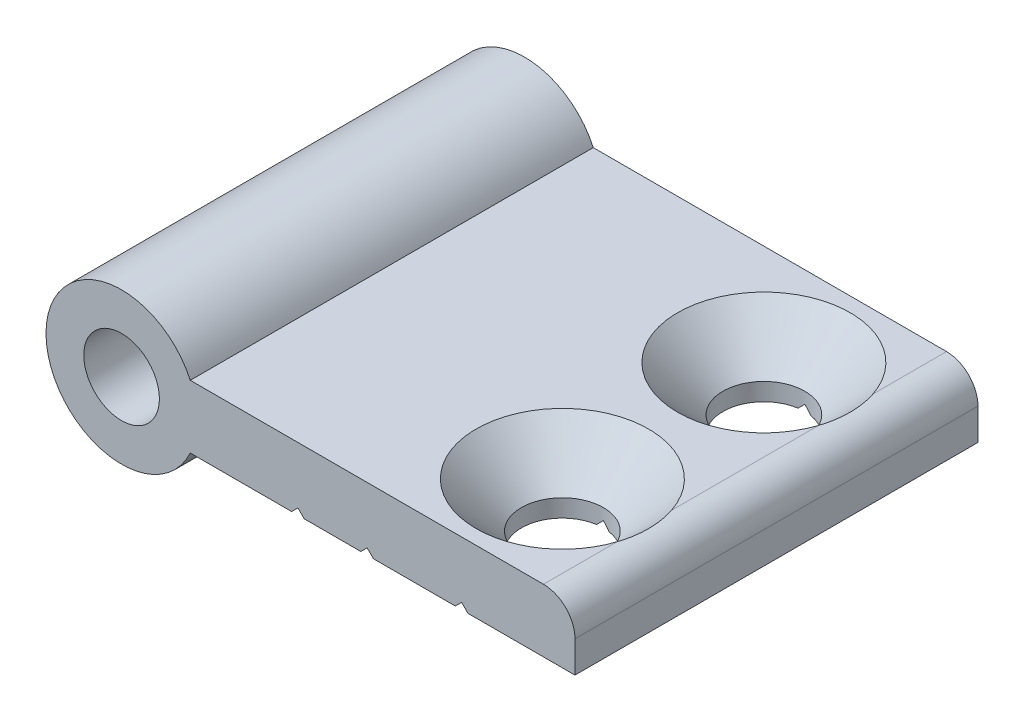
ISO-10303-21;
HEADER;
FILE_DESCRIPTION(('STEP AP214'),'2;1');
FILE_NAME('part.step','',(''),(''),'','','');
FILE_SCHEMA(('AUTOMOTIVE_DESIGN { 1 0 10303 214 1 1 1 1 }'));
ENDSEC;
DATA;
#1=APPLICATION_CONTEXT('core data for automotive mechanical design processes');
#2=APPLICATION_PROTOCOL_DEFINITION('international standard','automotive_design',2000,#1);
#3=PRODUCT_CONTEXT('',#1,'mechanical');
#4=PRODUCT('Part','Part','',(#3));
#5=PRODUCT_RELATED_PRODUCT_CATEGORY('part','',(#4));
#6=PRODUCT_DEFINITION_FORMATION('','',#4);
#7=PRODUCT_DEFINITION_CONTEXT('part definition',#1,'design');
#8=PRODUCT_DEFINITION('design','',#6,#7);
#9=PRODUCT_DEFINITION_SHAPE('','',#8);
#10=(LENGTH_UNIT() NAMED_UNIT(*) SI_UNIT(.MILLI.,.METRE.));
#11=(NAMED_UNIT(*) PLANE_ANGLE_UNIT() SI_UNIT($,.RADIAN.));
#12=(NAMED_UNIT(*) SI_UNIT($,.STERADIAN.) SOLID_ANGLE_UNIT());
#13=UNCERTAINTY_MEASURE_WITH_UNIT(LENGTH_MEASURE(1.E-05),#10,'distance_accuracy_value','');
#14=(GEOMETRIC_REPRESENTATION_CONTEXT(3) GLOBAL_UNCERTAINTY_ASSIGNED_CONTEXT((#13)) GLOBAL_UNIT_ASSIGNED_CONTEXT((#10,
#11,#12)) REPRESENTATION_CONTEXT('',''));
#15=CARTESIAN_POINT('',(0.,0.,0.));
#16=DIRECTION('',(0.,0.,1.));
#17=DIRECTION('',(1.,0.,0.));
#18=AXIS2_PLACEMENT_3D('',#15,#16,#17);
#19=CARTESIAN_POINT('',(19.,-2.5,0.));
#20=DIRECTION('',(0.707106781186547,-0.707106781186548,0.));
#21=DIRECTION('',(0.707106781186548,0.707106781186547,0.));
#22=AXIS2_PLACEMENT_3D('',#19,#20,#21);
#23=PLANE('',#22);
#24=DIRECTION('',(0.707106781186548,0.707106781186547,0.));
#25=VECTOR('',#24,1.);
#26=CARTESIAN_POINT('',(19.,-2.5,16.));
#27=LINE('',#26,#25);
#28=CARTESIAN_POINT('',(19.5,-2.,16.));
#29=VERTEX_POINT('',#28);
#30=CARTESIAN_POINT('',(19.,-2.5,16.));
#31=VERTEX_POINT('',#30);
#32=EDGE_CURVE('E248',#29,#31,#27,.F.);
#33=ORIENTED_EDGE('',*,*,#32,.T.);
#34=DIRECTION('',(0.,0.,-1.));
#35=VECTOR('',#34,1.);
#36=CARTESIAN_POINT('',(19.,-2.5,0.));
#37=LINE('',#36,#35);
#38=CARTESIAN_POINT('',(19.,-2.5,-16.));
#39=VERTEX_POINT('',#38);
#40=EDGE_CURVE('E139',#39,#31,#37,.F.);
#41=ORIENTED_EDGE('',*,*,#40,.F.);
#42=DIRECTION('',(0.707106781186548,0.707106781186547,0.));
#43=VECTOR('',#42,1.);
#44=CARTESIAN_POINT('',(19.,-2.5,-16.));
#45=LINE('',#44,#43);
#46=CARTESIAN_POINT('',(19.5,-2.,-16.));
#47=VERTEX_POINT('',#46);
#48=EDGE_CURVE('E252',#39,#47,#45,.T.);
#49=ORIENTED_EDGE('',*,*,#48,.T.);
#50=DIRECTION('',(0.,0.,1.));
#51=VECTOR('',#50,1.);
#52=CARTESIAN_POINT('',(19.5,-2.,0.));
#53=LINE('',#52,#51);
#54=EDGE_CURVE('E230',#29,#47,#53,.F.);
#55=ORIENTED_EDGE('',*,*,#54,.F.);
#56=EDGE_LOOP('',(#33,#41,#49,#55));
#57=FACE_BOUND('',#56,.T.);
#58=ADVANCED_FACE('F16',(#57),#23,.T.);
#59=CARTESIAN_POINT('',(14.,-2.,0.));
#60=DIRECTION('',(-0.707106781186547,-0.707106781186548,0.));
#61=DIRECTION('',(0.707106781186548,-0.707106781186547,0.));
#62=AXIS2_PLACEMENT_3D('',#59,#60,#61);
#63=PLANE('',#62);
#64=DIRECTION('',(0.707106781186548,-0.707106781186547,0.));
#65=VECTOR('',#64,1.);
#66=CARTESIAN_POINT('',(14.,-2.,16.));
#67=LINE('',#66,#65);
#68=CARTESIAN_POINT('',(14.5,-2.5,16.));
#69=VERTEX_POINT('',#68);
#70=CARTESIAN_POINT('',(14.,-2.,16.));
#71=VERTEX_POINT('',#70);
#72=EDGE_CURVE('E243',#69,#71,#67,.F.);
#73=ORIENTED_EDGE('',*,*,#72,.T.);
#74=DIRECTION('',(0.,0.,1.));
#75=VECTOR('',#74,1.);
#76=CARTESIAN_POINT('',(14.,-2.,0.));
#77=LINE('',#76,#75);
#78=CARTESIAN_POINT('',(14.,-2.,-16.));
#79=VERTEX_POINT('',#78);
#80=EDGE_CURVE('E145',#79,#71,#77,.T.);
#81=ORIENTED_EDGE('',*,*,#80,.F.);
#82=DIRECTION('',(0.707106781186548,-0.707106781186547,0.));
#83=VECTOR('',#82,1.);
#84=CARTESIAN_POINT('',(14.,-2.,-16.));
#85=LINE('',#84,#83);
#86=CARTESIAN_POINT('',(14.5,-2.5,-16.));
#87=VERTEX_POINT('',#86);
#88=EDGE_CURVE('E251',#79,#87,#85,.T.);
#89=ORIENTED_EDGE('',*,*,#88,.T.);
#90=DIRECTION('',(0.,0.,-1.));
#91=VECTOR('',#90,1.);
#92=CARTESIAN_POINT('',(14.5,-2.5,0.));
#93=LINE('',#92,#91);
#94=EDGE_CURVE('E136',#69,#87,#93,.T.);
#95=ORIENTED_EDGE('',*,*,#94,.F.);
#96=EDGE_LOOP('',(#73,#81,#89,#95));
#97=FACE_BOUND('',#96,.T.);
#98=ADVANCED_FACE('F354',(#97),#63,.T.);
#99=CARTESIAN_POINT('',(26.5,-2.5,0.));
#100=DIRECTION('',(0.707106781186549,-0.707106781186546,0.));
#101=DIRECTION('',(0.707106781186546,0.707106781186549,0.));
#102=AXIS2_PLACEMENT_3D('',#99,#100,#101);
#103=PLANE('',#102);
#104=CARTESIAN_POINT('',(27.,-2.,8.));
#105=DIRECTION('',(0.707106781186549,-0.707106781186546,0.));
#106=DIRECTION('',(-0.707106781186546,-0.707106781186549,0.));
#107=AXIS2_PLACEMENT_3D('',#104,#105,#106);
#108=ELLIPSE('',#107,4.59619407771257,3.25);
#109=CARTESIAN_POINT('',(27.,-2.,4.75));
#110=VERTEX_POINT('',#109);
#111=CARTESIAN_POINT('',(26.5,-2.5,4.78869185533372));
#112=VERTEX_POINT('',#111);
#113=EDGE_CURVE('E126',#110,#112,#108,.F.);
#114=ORIENTED_EDGE('',*,*,#113,.T.);
#115=DIRECTION('',(0.,0.,-1.));
#116=VECTOR('',#115,1.);
#117=CARTESIAN_POINT('',(26.5,-2.5,0.));
#118=LINE('',#117,#116);
#119=CARTESIAN_POINT('',(26.5,-2.5,-4.78869185533371));
#120=VERTEX_POINT('',#119);
#121=EDGE_CURVE('E123',#120,#112,#118,.F.);
#122=ORIENTED_EDGE('',*,*,#121,.F.);
#123=CARTESIAN_POINT('',(27.,-2.,-8.));
#124=DIRECTION('',(0.707106781186549,-0.707106781186546,0.));
#125=DIRECTION('',(-0.707106781186546,-0.707106781186549,0.));
#126=AXIS2_PLACEMENT_3D('',#123,#124,#125);
#127=ELLIPSE('',#126,4.59619407771257,3.25);
#128=CARTESIAN_POINT('',(27.,-2.,-4.75));
#129=VERTEX_POINT('',#128);
#130=EDGE_CURVE('E21',#120,#129,#127,.F.);
#131=ORIENTED_EDGE('',*,*,#130,.T.);
#132=DIRECTION('',(0.,0.,1.));
#133=VECTOR('',#132,1.);
#134=CARTESIAN_POINT('',(27.,-2.,0.));
#135=LINE('',#134,#133);
#136=EDGE_CURVE('E121',#110,#129,#135,.F.);
#137=ORIENTED_EDGE('',*,*,#136,.F.);
#138=EDGE_LOOP('',(#114,#122,#131,#137));
#139=FACE_BOUND('',#138,.T.);
#140=ADVANCED_FACE('F124',(#139),#103,.T.);
#141=CARTESIAN_POINT('',(26.5,-2.5,0.));
#142=DIRECTION('',(0.707106781186549,-0.707106781186546,0.));
#143=DIRECTION('',(0.707106781186546,0.707106781186549,0.));
#144=AXIS2_PLACEMENT_3D('',#141,#142,#143);
#145=PLANE('',#144);
#146=DIRECTION('',(0.707106781186546,0.707106781186549,0.));
#147=VECTOR('',#146,1.);
#148=CARTESIAN_POINT('',(26.5,-2.5,16.));
#149=LINE('',#148,#147);
#150=CARTESIAN_POINT('',(27.,-2.,16.));
#151=VERTEX_POINT('',#150);
#152=CARTESIAN_POINT('',(26.5,-2.5,16.));
#153=VERTEX_POINT('',#152);
#154=EDGE_CURVE('E240',#151,#153,#149,.F.);
#155=ORIENTED_EDGE('',*,*,#154,.T.);
#156=DIRECTION('',(0.,0.,-1.));
#157=VECTOR('',#156,1.);
#158=CARTESIAN_POINT('',(26.5,-2.5,0.));
#159=LINE('',#158,#157);
#160=CARTESIAN_POINT('',(26.5,-2.5,11.2113081446663));
#161=VERTEX_POINT('',#160);
#162=EDGE_CURVE('E189',#161,#153,#159,.F.);
#163=ORIENTED_EDGE('',*,*,#162,.F.);
#164=CARTESIAN_POINT('',(27.,-2.,8.));
#165=DIRECTION('',(0.707106781186549,-0.707106781186546,0.));
#166=DIRECTION('',(-0.707106781186546,-0.707106781186549,0.));
#167=AXIS2_PLACEMENT_3D('',#164,#165,#166);
#168=ELLIPSE('',#167,4.59619407771257,3.25);
#169=CARTESIAN_POINT('',(27.,-2.,11.25));
#170=VERTEX_POINT('',#169);
#171=EDGE_CURVE('E151',#161,#170,#168,.F.);
#172=ORIENTED_EDGE('',*,*,#171,.T.);
#173=DIRECTION('',(0.,0.,1.));
#174=VECTOR('',#173,1.);
#175=CARTESIAN_POINT('',(27.,-2.,0.));
#176=LINE('',#175,#174);
#177=EDGE_CURVE('E215',#151,#170,#176,.F.);
#178=ORIENTED_EDGE('',*,*,#177,.F.);
#179=EDGE_LOOP('',(#155,#163,#172,#178));
#180=FACE_BOUND('',#179,.T.);
#181=ADVANCED_FACE('F347',(#180),#145,.T.);
#182=CARTESIAN_POINT('',(19.5,-2.,0.));
#183=DIRECTION('',(-0.707106781186546,-0.707106781186549,0.));
#184=DIRECTION('',(0.707106781186549,-0.707106781186546,0.));
#185=AXIS2_PLACEMENT_3D('',#182,#183,#184);
#186=PLANE('',#185);
#187=DIRECTION('',(0.707106781186549,-0.707106781186546,0.));
#188=VECTOR('',#187,1.);
#189=CARTESIAN_POINT('',(19.5,-2.,16.));
#190=LINE('',#189,#188);
#191=CARTESIAN_POINT('',(20.,-2.5,16.));
#192=VERTEX_POINT('',#191);
#193=EDGE_CURVE('E234',#192,#29,#190,.F.);
#194=ORIENTED_EDGE('',*,*,#193,.T.);
#195=ORIENTED_EDGE('',*,*,#54,.T.);
#196=DIRECTION('',(0.707106781186549,-0.707106781186546,0.));
#197=VECTOR('',#196,1.);
#198=CARTESIAN_POINT('',(19.5,-2.,-16.));
#199=LINE('',#198,#197);
#200=CARTESIAN_POINT('',(20.,-2.5,-16.));
#201=VERTEX_POINT('',#200);
#202=EDGE_CURVE('E237',#47,#201,#199,.T.);
#203=ORIENTED_EDGE('',*,*,#202,.T.);
#204=DIRECTION('',(0.,0.,-1.));
#205=VECTOR('',#204,1.);
#206=CARTESIAN_POINT('',(20.,-2.5,0.));
#207=LINE('',#206,#205);
#208=EDGE_CURVE('E186',#192,#201,#207,.T.);
#209=ORIENTED_EDGE('',*,*,#208,.F.);
#210=EDGE_LOOP('',(#194,#195,#203,#209));
#211=FACE_BOUND('',#210,.T.);
#212=ADVANCED_FACE('F343',(#211),#186,.T.);
#213=CARTESIAN_POINT('',(26.5,-2.5,0.));
#214=DIRECTION('',(0.707106781186549,-0.707106781186546,0.));
#215=DIRECTION('',(0.707106781186546,0.707106781186549,0.));
#216=AXIS2_PLACEMENT_3D('',#213,#214,#215);
#217=PLANE('',#216);
#218=DIRECTION('',(0.707106781186546,0.707106781186549,0.));
#219=VECTOR('',#218,1.);
#220=CARTESIAN_POINT('',(26.5,-2.5,-16.));
#221=LINE('',#220,#219);
#222=CARTESIAN_POINT('',(26.5,-2.5,-16.));
#223=VERTEX_POINT('',#222);
#224=CARTESIAN_POINT('',(27.,-2.,-16.));
#225=VERTEX_POINT('',#224);
#226=EDGE_CURVE('E225',#223,#225,#221,.T.);
#227=ORIENTED_EDGE('',*,*,#226,.T.);
#228=DIRECTION('',(0.,0.,1.));
#229=VECTOR('',#228,1.);
#230=CARTESIAN_POINT('',(27.,-2.,0.));
#231=LINE('',#230,#229);
#232=CARTESIAN_POINT('',(27.,-2.,-11.25));
#233=VERTEX_POINT('',#232);
#234=EDGE_CURVE('E222',#233,#225,#231,.F.);
#235=ORIENTED_EDGE('',*,*,#234,.F.);
#236=CARTESIAN_POINT('',(27.,-2.,-8.));
#237=DIRECTION('',(0.707106781186549,-0.707106781186546,0.));
#238=DIRECTION('',(-0.707106781186546,-0.707106781186549,0.));
#239=AXIS2_PLACEMENT_3D('',#236,#237,#238);
#240=ELLIPSE('',#239,4.59619407771257,3.25);
#241=CARTESIAN_POINT('',(26.5,-2.5,-11.2113081446663));
#242=VERTEX_POINT('',#241);
#243=EDGE_CURVE('E153',#233,#242,#240,.F.);
#244=ORIENTED_EDGE('',*,*,#243,.T.);
#245=DIRECTION('',(0.,0.,-1.));
#246=VECTOR('',#245,1.);
#247=CARTESIAN_POINT('',(26.5,-2.5,0.));
#248=LINE('',#247,#246);
#249=EDGE_CURVE('E135',#223,#242,#248,.F.);
#250=ORIENTED_EDGE('',*,*,#249,.F.);
#251=EDGE_LOOP('',(#227,#235,#244,#250));
#252=FACE_BOUND('',#251,.T.);
#253=ADVANCED_FACE('F339',(#252),#217,.T.);
#254=CARTESIAN_POINT('',(27.,-2.,0.));
#255=DIRECTION('',(-0.707106781186549,-0.707106781186546,0.));
#256=DIRECTION('',(0.707106781186546,-0.707106781186549,0.));
#257=AXIS2_PLACEMENT_3D('',#254,#255,#256);
#258=PLANE('',#257);
#259=DIRECTION('',(0.707106781186546,-0.707106781186549,0.));
#260=VECTOR('',#259,1.);
#261=CARTESIAN_POINT('',(27.,-2.,-16.));
#262=LINE('',#261,#260);
#263=CARTESIAN_POINT('',(27.5,-2.5,-16.));
#264=VERTEX_POINT('',#263);
#265=EDGE_CURVE('E221',#225,#264,#262,.T.);
#266=ORIENTED_EDGE('',*,*,#265,.T.);
#267=DIRECTION('',(0.,0.,-1.));
#268=VECTOR('',#267,1.);
#269=CARTESIAN_POINT('',(27.5,-2.5,0.));
#270=LINE('',#269,#268);
#271=CARTESIAN_POINT('',(27.5,-2.5,-11.2113081446663));
#272=VERTEX_POINT('',#271);
#273=EDGE_CURVE('E168',#272,#264,#270,.T.);
#274=ORIENTED_EDGE('',*,*,#273,.F.);
#275=CARTESIAN_POINT('',(27.,-2.,-8.));
#276=DIRECTION('',(-0.707106781186549,-0.707106781186546,0.));
#277=DIRECTION('',(0.707106781186546,-0.707106781186549,0.));
#278=AXIS2_PLACEMENT_3D('',#275,#276,#277);
#279=ELLIPSE('',#278,4.59619407771257,3.25);
#280=EDGE_CURVE('E155',#272,#233,#279,.F.);
#281=ORIENTED_EDGE('',*,*,#280,.T.);
#282=ORIENTED_EDGE('',*,*,#234,.T.);
#283=EDGE_LOOP('',(#266,#274,#281,#282));
#284=FACE_BOUND('',#283,.T.);
#285=ADVANCED_FACE('F335',(#284),#258,.T.);
#286=CARTESIAN_POINT('',(27.,-2.,0.));
#287=DIRECTION('',(-0.707106781186549,-0.707106781186546,0.));
#288=DIRECTION('',(0.707106781186546,-0.707106781186549,0.));
#289=AXIS2_PLACEMENT_3D('',#286,#287,#288);
#290=PLANE('',#289);
#291=DIRECTION('',(0.707106781186546,-0.707106781186549,0.));
#292=VECTOR('',#291,1.);
#293=CARTESIAN_POINT('',(27.,-2.,16.));
#294=LINE('',#293,#292);
#295=CARTESIAN_POINT('',(27.5,-2.5,16.));
#296=VERTEX_POINT('',#295);
#297=EDGE_CURVE('E218',#296,#151,#294,.F.);
#298=ORIENTED_EDGE('',*,*,#297,.T.);
#299=ORIENTED_EDGE('',*,*,#177,.T.);
#300=CARTESIAN_POINT('',(27.,-2.,8.));
#301=DIRECTION('',(-0.707106781186549,-0.707106781186546,0.));
#302=DIRECTION('',(0.707106781186546,-0.707106781186549,0.));
#303=AXIS2_PLACEMENT_3D('',#300,#301,#302);
#304=ELLIPSE('',#303,4.59619407771257,3.25);
#305=CARTESIAN_POINT('',(27.5,-2.5,11.2113081446663));
#306=VERTEX_POINT('',#305);
#307=EDGE_CURVE('E149',#170,#306,#304,.F.);
#308=ORIENTED_EDGE('',*,*,#307,.T.);
#309=DIRECTION('',(0.,0.,-1.));
#310=VECTOR('',#309,1.);
#311=CARTESIAN_POINT('',(27.5,-2.5,0.));
#312=LINE('',#311,#310);
#313=EDGE_CURVE('E178',#296,#306,#312,.T.);
#314=ORIENTED_EDGE('',*,*,#313,.F.);
#315=EDGE_LOOP('',(#298,#299,#308,#314));
#316=FACE_BOUND('',#315,.T.);
#317=ADVANCED_FACE('F332',(#316),#290,.T.);
#318=CARTESIAN_POINT('',(27.,-2.,0.));
#319=DIRECTION('',(-0.707106781186549,-0.707106781186546,0.));
#320=DIRECTION('',(0.707106781186546,-0.707106781186549,0.));
#321=AXIS2_PLACEMENT_3D('',#318,#319,#320);
#322=PLANE('',#321);
#323=CARTESIAN_POINT('',(27.,-2.,8.));
#324=DIRECTION('',(-0.707106781186549,-0.707106781186546,0.));
#325=DIRECTION('',(0.707106781186546,-0.707106781186549,0.));
#326=AXIS2_PLACEMENT_3D('',#323,#324,#325);
#327=ELLIPSE('',#326,4.59619407771257,3.25);
#328=CARTESIAN_POINT('',(27.5,-2.5,4.78869185533372));
#329=VERTEX_POINT('',#328);
#330=EDGE_CURVE('E146',#329,#110,#327,.F.);
#331=ORIENTED_EDGE('',*,*,#330,.T.);
#332=ORIENTED_EDGE('',*,*,#136,.T.);
#333=CARTESIAN_POINT('',(27.,-2.,-8.));
#334=DIRECTION('',(-0.707106781186549,-0.707106781186546,0.));
#335=DIRECTION('',(0.707106781186546,-0.707106781186549,0.));
#336=AXIS2_PLACEMENT_3D('',#333,#334,#335);
#337=ELLIPSE('',#336,4.59619407771257,3.25);
#338=CARTESIAN_POINT('',(27.5,-2.5,-4.78869185533371));
#339=VERTEX_POINT('',#338);
#340=EDGE_CURVE('E118',#129,#339,#337,.F.);
#341=ORIENTED_EDGE('',*,*,#340,.T.);
#342=DIRECTION('',(0.,0.,-1.));
#343=VECTOR('',#342,1.);
#344=CARTESIAN_POINT('',(27.5,-2.5,0.));
#345=LINE('',#344,#343);
#346=EDGE_CURVE('E161',#329,#339,#345,.T.);
#347=ORIENTED_EDGE('',*,*,#346,.F.);
#348=EDGE_LOOP('',(#331,#332,#341,#347));
#349=FACE_BOUND('',#348,.T.);
#350=ADVANCED_FACE('F159',(#349),#322,.T.);
#351=CARTESIAN_POINT('',(27.,-1.09999999999999,-8.));
#352=DIRECTION('',(0.,-1.,0.));
#353=DIRECTION('',(0.,0.,-1.));
#354=AXIS2_PLACEMENT_3D('',#351,#352,#353);
#355=CYLINDRICAL_SURFACE('',#354,3.25);
#356=CARTESIAN_POINT('',(27.,-1.1,-8.));
#357=DIRECTION('',(0.,1.,0.));
#358=DIRECTION('',(0.,0.,1.));
#359=AXIS2_PLACEMENT_3D('',#356,#357,#358);
#360=CIRCLE('',#359,3.25);
#361=CARTESIAN_POINT('',(27.,-1.1,-4.75));
#362=VERTEX_POINT('',#361);
#363=EDGE_CURVE('E176',#362,#362,#360,.T.);
#364=ORIENTED_EDGE('',*,*,#363,.T.);
#365=EDGE_LOOP('',(#364));
#366=FACE_BOUND('',#365,.T.);
#367=ORIENTED_EDGE('',*,*,#243,.F.);
#368=ORIENTED_EDGE('',*,*,#280,.F.);
#369=CARTESIAN_POINT('',(27.,-2.5,-8.));
#370=DIRECTION('',(0.,-1.,0.));
#371=DIRECTION('',(0.,0.,-1.));
#372=AXIS2_PLACEMENT_3D('',#369,#370,#371);
#373=CIRCLE('',#372,3.25);
#374=EDGE_CURVE('E164',#339,#272,#373,.F.);
#375=ORIENTED_EDGE('',*,*,#374,.F.);
#376=ORIENTED_EDGE('',*,*,#340,.F.);
#377=ORIENTED_EDGE('',*,*,#130,.F.);
#378=CARTESIAN_POINT('',(27.,-2.5,-8.));
#379=DIRECTION('',(0.,-1.,0.));
#380=DIRECTION('',(0.,0.,-1.));
#381=AXIS2_PLACEMENT_3D('',#378,#379,#380);
#382=CIRCLE('',#381,3.25);
#383=EDGE_CURVE('E115',#242,#120,#382,.F.);
#384=ORIENTED_EDGE('',*,*,#383,.F.);
#385=EDGE_LOOP('',(#367,#368,#375,#376,#377,#384));
#386=FACE_BOUND('',#385,.T.);
#387=ADVANCED_FACE('F113',(#366,#386),#355,.F.);
#388=CARTESIAN_POINT('',(27.,-1.09999999999999,8.));
#389=DIRECTION('',(0.,-1.,0.));
#390=DIRECTION('',(0.,0.,-1.));
#391=AXIS2_PLACEMENT_3D('',#388,#389,#390);
#392=CYLINDRICAL_SURFACE('',#391,3.25);
#393=CARTESIAN_POINT('',(27.,-1.1,8.));
#394=DIRECTION('',(0.,1.,0.));
#395=DIRECTION('',(0.,0.,1.));
#396=AXIS2_PLACEMENT_3D('',#393,#394,#395);
#397=CIRCLE('',#396,3.25);
#398=CARTESIAN_POINT('',(27.,-1.1,11.25));
#399=VERTEX_POINT('',#398);
#400=EDGE_CURVE('E415',#399,#399,#397,.T.);
#401=ORIENTED_EDGE('',*,*,#400,.T.);
#402=EDGE_LOOP('',(#401));
#403=FACE_BOUND('',#402,.T.);
#404=ORIENTED_EDGE('',*,*,#113,.F.);
#405=ORIENTED_EDGE('',*,*,#330,.F.);
#406=CARTESIAN_POINT('',(27.,-2.5,8.));
#407=DIRECTION('',(0.,-1.,0.));
#408=DIRECTION('',(0.,0.,-1.));
#409=AXIS2_PLACEMENT_3D('',#406,#407,#408);
#410=CIRCLE('',#409,3.25);
#411=EDGE_CURVE('E172',#306,#329,#410,.F.);
#412=ORIENTED_EDGE('',*,*,#411,.F.);
#413=ORIENTED_EDGE('',*,*,#307,.F.);
#414=ORIENTED_EDGE('',*,*,#171,.F.);
#415=CARTESIAN_POINT('',(27.,-2.5,8.));
#416=DIRECTION('',(0.,-1.,0.));
#417=DIRECTION('',(0.,0.,-1.));
#418=AXIS2_PLACEMENT_3D('',#415,#416,#417);
#419=CIRCLE('',#418,3.25);
#420=EDGE_CURVE('E130',#112,#161,#419,.F.);
#421=ORIENTED_EDGE('',*,*,#420,.F.);
#422=EDGE_LOOP('',(#404,#405,#412,#413,#414,#421));
#423=FACE_BOUND('',#422,.T.);
#424=ADVANCED_FACE('F328',(#403,#423),#392,.F.);
#425=CARTESIAN_POINT('',(13.5,-2.5,0.));
#426=DIRECTION('',(0.707106781186547,-0.707106781186548,0.));
#427=DIRECTION('',(0.707106781186548,0.707106781186547,0.));
#428=AXIS2_PLACEMENT_3D('',#425,#426,#427);
#429=PLANE('',#428);
#430=DIRECTION('',(0.707106781186548,0.707106781186547,0.));
#431=VECTOR('',#430,1.);
#432=CARTESIAN_POINT('',(13.5,-2.5,16.));
#433=LINE('',#432,#431);
#434=CARTESIAN_POINT('',(13.5,-2.5,16.));
#435=VERTEX_POINT('',#434);
#436=EDGE_CURVE('E194',#71,#435,#433,.F.);
#437=ORIENTED_EDGE('',*,*,#436,.T.);
#438=DIRECTION('',(0.,0.,-1.));
#439=VECTOR('',#438,1.);
#440=CARTESIAN_POINT('',(13.5,-2.5,0.));
#441=LINE('',#440,#439);
#442=CARTESIAN_POINT('',(13.5,-2.5,-16.));
#443=VERTEX_POINT('',#442);
#444=EDGE_CURVE('E195',#443,#435,#441,.F.);
#445=ORIENTED_EDGE('',*,*,#444,.F.);
#446=DIRECTION('',(0.707106781186549,0.707106781186546,0.));
#447=VECTOR('',#446,1.);
#448=CARTESIAN_POINT('',(13.5,-2.5,-16.));
#449=LINE('',#448,#447);
#450=EDGE_CURVE('E202',#443,#79,#449,.T.);
#451=ORIENTED_EDGE('',*,*,#450,.T.);
#452=ORIENTED_EDGE('',*,*,#80,.T.);
#453=EDGE_LOOP('',(#437,#445,#451,#452));
#454=FACE_BOUND('',#453,.T.);
#455=ADVANCED_FACE('F324',(#454),#429,.T.);
#456=CARTESIAN_POINT('',(14.5,-2.5,0.));
#457=DIRECTION('',(0.,-1.,0.));
#458=DIRECTION('',(0.,0.,-1.));
#459=AXIS2_PLACEMENT_3D('',#456,#457,#458);
#460=PLANE('',#459);
#461=DIRECTION('',(1.,0.,0.));
#462=VECTOR('',#461,1.);
#463=CARTESIAN_POINT('',(14.3886766748367,-2.5,16.));
#464=LINE('',#463,#462);
#465=EDGE_CURVE('E247',#69,#31,#464,.T.);
#466=ORIENTED_EDGE('',*,*,#465,.F.);
#467=ORIENTED_EDGE('',*,*,#94,.T.);
#468=DIRECTION('',(1.,0.,0.));
#469=VECTOR('',#468,1.);
#470=CARTESIAN_POINT('',(14.3886766748367,-2.5,-16.));
#471=LINE('',#470,#469);
#472=EDGE_CURVE('E205',#87,#39,#471,.T.);
#473=ORIENTED_EDGE('',*,*,#472,.T.);
#474=ORIENTED_EDGE('',*,*,#40,.T.);
#475=EDGE_LOOP('',(#466,#467,#473,#474));
#476=FACE_BOUND('',#475,.T.);
#477=ADVANCED_FACE('F321',(#476),#460,.T.);
#478=CARTESIAN_POINT('',(20.,-2.5,0.));
#479=DIRECTION('',(0.,-1.,0.));
#480=DIRECTION('',(0.,0.,-1.));
#481=AXIS2_PLACEMENT_3D('',#478,#479,#480);
#482=PLANE('',#481);
#483=DIRECTION('',(1.,0.,0.));
#484=VECTOR('',#483,1.);
#485=CARTESIAN_POINT('',(14.3886766748367,-2.5,-16.));
#486=LINE('',#485,#484);
#487=EDGE_CURVE('E211',#201,#223,#486,.T.);
#488=ORIENTED_EDGE('',*,*,#487,.T.);
#489=ORIENTED_EDGE('',*,*,#249,.T.);
#490=ORIENTED_EDGE('',*,*,#383,.T.);
#491=ORIENTED_EDGE('',*,*,#121,.T.);
#492=ORIENTED_EDGE('',*,*,#420,.T.);
#493=ORIENTED_EDGE('',*,*,#162,.T.);
#494=DIRECTION('',(1.,0.,0.));
#495=VECTOR('',#494,1.);
#496=CARTESIAN_POINT('',(14.3886766748367,-2.5,16.));
#497=LINE('',#496,#495);
#498=EDGE_CURVE('E244',#192,#153,#497,.T.);
#499=ORIENTED_EDGE('',*,*,#498,.F.);
#500=ORIENTED_EDGE('',*,*,#208,.T.);
#501=EDGE_LOOP('',(#488,#489,#490,#491,#492,#493,#499,#500));
#502=FACE_BOUND('',#501,.T.);
#503=ADVANCED_FACE('F133',(#502),#482,.T.);
#504=CARTESIAN_POINT('',(27.5,-2.5,0.));
#505=DIRECTION('',(0.,-1.,0.));
#506=DIRECTION('',(0.,0.,-1.));
#507=AXIS2_PLACEMENT_3D('',#504,#505,#506);
#508=PLANE('',#507);
#509=ORIENTED_EDGE('',*,*,#411,.T.);
#510=ORIENTED_EDGE('',*,*,#346,.T.);
#511=ORIENTED_EDGE('',*,*,#374,.T.);
#512=ORIENTED_EDGE('',*,*,#273,.T.);
#513=DIRECTION('',(1.,0.,0.));
#514=VECTOR('',#513,1.);
#515=CARTESIAN_POINT('',(14.3886766748367,-2.5,-16.));
#516=LINE('',#515,#514);
#517=CARTESIAN_POINT('',(36.,-2.5,-16.));
#518=VERTEX_POINT('',#517);
#519=EDGE_CURVE('E207',#264,#518,#516,.T.);
#520=ORIENTED_EDGE('',*,*,#519,.T.);
#521=DIRECTION('',(0.,0.,-1.));
#522=VECTOR('',#521,1.);
#523=CARTESIAN_POINT('',(36.,-2.5,0.));
#524=LINE('',#523,#522);
#525=CARTESIAN_POINT('',(36.,-2.5,16.));
#526=VERTEX_POINT('',#525);
#527=EDGE_CURVE('E173',#526,#518,#524,.T.);
#528=ORIENTED_EDGE('',*,*,#527,.F.);
#529=DIRECTION('',(1.,0.,0.));
#530=VECTOR('',#529,1.);
#531=CARTESIAN_POINT('',(14.3886766748367,-2.5,16.));
#532=LINE('',#531,#530);
#533=EDGE_CURVE('E182',#296,#526,#532,.T.);
#534=ORIENTED_EDGE('',*,*,#533,.F.);
#535=ORIENTED_EDGE('',*,*,#313,.T.);
#536=EDGE_LOOP('',(#509,#510,#511,#512,#520,#528,#534,#535));
#537=FACE_BOUND('',#536,.T.);
#538=ADVANCED_FACE('F169',(#537),#508,.T.);
#539=CARTESIAN_POINT('',(36.,-2.5,0.));
#540=DIRECTION('',(1.,0.,0.));
#541=DIRECTION('',(0.,0.,-1.));
#542=AXIS2_PLACEMENT_3D('',#539,#540,#541);
#543=PLANE('',#542);
#544=DIRECTION('',(0.,1.,0.));
#545=VECTOR('',#544,1.);
#546=CARTESIAN_POINT('',(36.,-0.053688417283162,16.));
#547=LINE('',#546,#545);
#548=CARTESIAN_POINT('',(36.,0.,16.));
#549=VERTEX_POINT('',#548);
#550=EDGE_CURVE('E283',#526,#549,#547,.T.);
#551=ORIENTED_EDGE('',*,*,#550,.F.);
#552=ORIENTED_EDGE('',*,*,#527,.T.);
#553=DIRECTION('',(0.,1.,0.));
#554=VECTOR('',#553,1.);
#555=CARTESIAN_POINT('',(36.,-0.053688417283162,-16.));
#556=LINE('',#555,#554);
#557=CARTESIAN_POINT('',(36.,0.,-16.));
#558=VERTEX_POINT('',#557);
#559=EDGE_CURVE('E210',#518,#558,#556,.T.);
#560=ORIENTED_EDGE('',*,*,#559,.T.);
#561=DIRECTION('',(0.,0.,-1.));
#562=VECTOR('',#561,1.);
#563=CARTESIAN_POINT('',(36.,0.,0.));
#564=LINE('',#563,#562);
#565=EDGE_CURVE('E206',#549,#558,#564,.T.);
#566=ORIENTED_EDGE('',*,*,#565,.F.);
#567=EDGE_LOOP('',(#551,#552,#560,#566));
#568=FACE_BOUND('',#567,.T.);
#569=ADVANCED_FACE('F312',(#568),#543,.T.);
#570=CARTESIAN_POINT('',(0.,0.,0.));
#571=DIRECTION('',(0.,0.,-1.));
#572=DIRECTION('',(-1.,0.,0.));
#573=AXIS2_PLACEMENT_3D('',#570,#571,#572);
#574=CYLINDRICAL_SURFACE('',#573,3.);
#575=CARTESIAN_POINT('',(0.,0.,-16.));
#576=DIRECTION('',(0.,0.,-1.));
#577=DIRECTION('',(-1.,0.,0.));
#578=AXIS2_PLACEMENT_3D('',#575,#576,#577);
#579=CIRCLE('',#578,3.);
#580=CARTESIAN_POINT('',(-3.,0.,-16.));
#581=VERTEX_POINT('',#580);
#582=EDGE_CURVE('E284',#581,#581,#579,.T.);
#583=ORIENTED_EDGE('',*,*,#582,.T.);
#584=EDGE_LOOP('',(#583));
#585=FACE_BOUND('',#584,.T.);
#586=CARTESIAN_POINT('',(0.,0.,16.));
#587=DIRECTION('',(0.,0.,-1.));
#588=DIRECTION('',(-1.,0.,0.));
#589=AXIS2_PLACEMENT_3D('',#586,#587,#588);
#590=CIRCLE('',#589,3.);
#591=CARTESIAN_POINT('',(-3.,0.,16.));
#592=VERTEX_POINT('',#591);
#593=EDGE_CURVE('E278',#592,#592,#590,.T.);
#594=ORIENTED_EDGE('',*,*,#593,.F.);
#595=EDGE_LOOP('',(#594));
#596=FACE_BOUND('',#595,.T.);
#597=ADVANCED_FACE('F307',(#585,#596),#574,.F.);
#598=CARTESIAN_POINT('',(27.,2.5,-8.));
#599=DIRECTION('',(0.,1.,0.));
#600=DIRECTION('',(0.,0.,1.));
#601=AXIS2_PLACEMENT_3D('',#598,#599,#600);
#602=CONICAL_SURFACE('',#601,6.85,0.785398163397449);
#603=ORIENTED_EDGE('',*,*,#363,.F.);
#604=EDGE_LOOP('',(#603));
#605=FACE_BOUND('',#604,.T.);
#606=CARTESIAN_POINT('',(27.,2.5,-8.));
#607=DIRECTION('',(0.,1.,0.));
#608=DIRECTION('',(0.,0.,1.));
#609=AXIS2_PLACEMENT_3D('',#606,#607,#608);
#610=CIRCLE('',#609,6.85);
#611=CARTESIAN_POINT('',(33.5,2.5,-5.83840336787828));
#612=VERTEX_POINT('',#611);
#613=CARTESIAN_POINT('',(33.5,2.5,-10.1615966321217));
#614=VERTEX_POINT('',#613);
#615=EDGE_CURVE('E274',#612,#614,#610,.F.);
#616=ORIENTED_EDGE('',*,*,#615,.F.);
#617=CARTESIAN_POINT('',(33.5,2.5,-10.1615966321217));
#618=CARTESIAN_POINT('',(33.5284854953985,2.49998413686564,-10.075892504031));
#619=CARTESIAN_POINT('',(33.5548362124665,2.49951308747453,-9.98949965534697));
#620=CARTESIAN_POINT('',(33.6035194794252,2.49797862949295,-9.81562252741324));
#621=CARTESIAN_POINT('',(33.6258533665827,2.49691541852724,-9.72813862180432));
#622=CARTESIAN_POINT('',(33.6667449913902,2.4945158608883,-9.55242830860069));
#623=CARTESIAN_POINT('',(33.685307859915,2.49317989036704,-9.46420308229175));
#624=CARTESIAN_POINT('',(33.7188836665458,2.4904562532728,-9.28707800728814));
#625=CARTESIAN_POINT('',(33.733896266579,2.48906858179118,-9.19817809517807));
#626=CARTESIAN_POINT('',(33.7732591568449,2.48516247725169,-8.93460537823119));
#627=CARTESIAN_POINT('',(33.7928130238934,2.48283149126358,-8.75919425524095));
#628=CARTESIAN_POINT('',(33.8196416112109,2.47951667363616,-8.40735458908126));
#629=CARTESIAN_POINT('',(33.826909362067,2.47853360667605,-8.23092552537075));
#630=CARTESIAN_POINT('',(33.8294580719379,2.47819738229212,-7.86911513900038));
#631=CARTESIAN_POINT('',(33.8241188363872,2.47892854307829,-7.68372911950164));
#632=CARTESIAN_POINT('',(33.7999579972102,2.48197138505783,-7.31391500741253));
#633=CARTESIAN_POINT('',(33.781143324256,2.48428225374975,-7.12948647146441));
#634=CARTESIAN_POINT('',(33.7419546210056,2.48829763660098,-6.85224055165586));
#635=CARTESIAN_POINT('',(33.7268264320395,2.4897473784936,-6.75865643981741));
#636=CARTESIAN_POINT('',(33.6926732553632,2.49262354461978,-6.57220470692549));
#637=CARTESIAN_POINT('',(33.6736486759123,2.49404997127938,-6.47933701186367));
#638=CARTESIAN_POINT('',(33.6314638210351,2.49663198447792,-6.29440294435852));
#639=CARTESIAN_POINT('',(33.6082979812732,2.49778720171914,-6.20233782702811));
#640=CARTESIAN_POINT('',(33.5575417808061,2.49946175696113,-6.01939638028011));
#641=CARTESIAN_POINT('',(33.5299497876467,2.49998085973752,-5.92852050290506));
#642=CARTESIAN_POINT('',(33.5,2.5,-5.83840336787826));
#643=B_SPLINE_CURVE_WITH_KNOTS('',3,(#617,#618,#619,#620,#621,#622,#623,#624,#625,#626,#627,
#628,#629,#630,#631,#632,#633,#634,#635,#636,#637,#638,#639,#640,#641,#642),.UNSPECIFIED.,.F.,
.F.,(4,2,2,2,2,2,2,2,2,2,2,2,4),(0.,0.270884240078315,0.541678130864511,0.812101072758888,
1.08254975520108,1.61158507054597,2.14092038547559,2.69683426870737,3.25246244005164,
3.53682490289298,3.82115758578741,4.10587521901782,4.39069810428501),.UNSPECIFIED.);
#644=EDGE_CURVE('E295',#614,#612,#643,.T.);
#645=ORIENTED_EDGE('',*,*,#644,.F.);
#646=EDGE_LOOP('',(#616,#645));
#647=FACE_BOUND('',#646,.T.);
#648=ADVANCED_FACE('F311',(#605,#647),#602,.F.);
#649=CARTESIAN_POINT('',(27.,2.5,8.));
#650=DIRECTION('',(0.,1.,0.));
#651=DIRECTION('',(0.,0.,1.));
#652=AXIS2_PLACEMENT_3D('',#649,#650,#651);
#653=CONICAL_SURFACE('',#652,6.85,0.785398163397449);
#654=ORIENTED_EDGE('',*,*,#400,.F.);
#655=EDGE_LOOP('',(#654));
#656=FACE_BOUND('',#655,.T.);
#657=CARTESIAN_POINT('',(27.,2.5,8.));
#658=DIRECTION('',(0.,1.,0.));
#659=DIRECTION('',(0.,0.,1.));
#660=AXIS2_PLACEMENT_3D('',#657,#658,#659);
#661=CIRCLE('',#660,6.85);
#662=CARTESIAN_POINT('',(33.5,2.5,10.1615966321217));
#663=VERTEX_POINT('',#662);
#664=CARTESIAN_POINT('',(33.5,2.5,5.83840336787827));
#665=VERTEX_POINT('',#664);
#666=EDGE_CURVE('E270',#663,#665,#661,.F.);
#667=ORIENTED_EDGE('',*,*,#666,.F.);
#668=CARTESIAN_POINT('',(33.5,2.5,5.83840336787827));
#669=CARTESIAN_POINT('',(33.5284854953985,2.49998413686564,5.92410749596898));
#670=CARTESIAN_POINT('',(33.5548362124665,2.49951308747453,6.01050034465303));
#671=CARTESIAN_POINT('',(33.6035194794252,2.49797862949295,6.18437747258676));
#672=CARTESIAN_POINT('',(33.6258533665827,2.49691541852724,6.27186137819568));
#673=CARTESIAN_POINT('',(33.6667449913902,2.4945158608883,6.4475716913993));
#674=CARTESIAN_POINT('',(33.685307859915,2.49317989036704,6.53579691770825));
#675=CARTESIAN_POINT('',(33.7188836665459,2.4904562532728,6.71292199271186));
#676=CARTESIAN_POINT('',(33.733896266579,2.48906858179118,6.80182190482194));
#677=CARTESIAN_POINT('',(33.7732591568449,2.48516247725169,7.06539462176882));
#678=CARTESIAN_POINT('',(33.7928130238935,2.48283149126358,7.24080574475905));
#679=CARTESIAN_POINT('',(33.8196416112109,2.47951667363616,7.59264541091874));
#680=CARTESIAN_POINT('',(33.826909362067,2.47853360667605,7.76907447462926));
#681=CARTESIAN_POINT('',(33.8294580719379,2.47819738229212,8.13088486099963));
#682=CARTESIAN_POINT('',(33.8241188363872,2.47892854307829,8.31627088049837));
#683=CARTESIAN_POINT('',(33.7999579972102,2.48197138505783,8.68608499258748));
#684=CARTESIAN_POINT('',(33.7811433242559,2.48428225374975,8.8705135285356));
#685=CARTESIAN_POINT('',(33.7419546210056,2.48829763660098,9.14775944834415));
#686=CARTESIAN_POINT('',(33.7268264320395,2.4897473784936,9.24134356018259));
#687=CARTESIAN_POINT('',(33.6926732553632,2.49262354461978,9.42779529307451));
#688=CARTESIAN_POINT('',(33.6736486759123,2.49404997127938,9.52066298813633));
#689=CARTESIAN_POINT('',(33.6314638210351,2.49663198447792,9.70559705564148));
#690=CARTESIAN_POINT('',(33.6082979812733,2.49778720171914,9.79766217297189));
#691=CARTESIAN_POINT('',(33.5575417808061,2.49946175696113,9.98060361971989));
#692=CARTESIAN_POINT('',(33.5299497876467,2.49998085973752,10.0714794970949));
#693=CARTESIAN_POINT('',(33.5,2.5,10.1615966321217));
#694=B_SPLINE_CURVE_WITH_KNOTS('',3,(#668,#669,#670,#671,#672,#673,#674,#675,#676,#677,#678,
#679,#680,#681,#682,#683,#684,#685,#686,#687,#688,#689,#690,#691,#692,#693),.UNSPECIFIED.,.F.,
.F.,(4,2,2,2,2,2,2,2,2,2,2,2,4),(0.,0.270884240078318,0.541678130864515,0.812101072758893,
1.08254975520109,1.61158507054598,2.1409203854756,2.69683426870738,3.25246244005165,
3.53682490289299,3.82115758578742,4.10587521901783,4.39069810428501),.UNSPECIFIED.);
#695=EDGE_CURVE('E289',#665,#663,#694,.T.);
#696=ORIENTED_EDGE('',*,*,#695,.F.);
#697=EDGE_LOOP('',(#667,#696));
#698=FACE_BOUND('',#697,.T.);
#699=ADVANCED_FACE('F18',(#656,#698),#653,.F.);
#700=CARTESIAN_POINT('',(33.5,0.,0.));
#701=DIRECTION('',(0.,0.,-1.));
#702=DIRECTION('',(-1.,0.,0.));
#703=AXIS2_PLACEMENT_3D('',#700,#701,#702);
#704=CYLINDRICAL_SURFACE('',#703,2.5);
#705=CARTESIAN_POINT('',(33.5,0.,-16.));
#706=DIRECTION('',(0.,0.,-1.));
#707=DIRECTION('',(-1.,0.,0.));
#708=AXIS2_PLACEMENT_3D('',#705,#706,#707);
#709=CIRCLE('',#708,2.5);
#710=CARTESIAN_POINT('',(33.5,2.5,-16.));
#711=VERTEX_POINT('',#710);
#712=EDGE_CURVE('E287',#558,#711,#709,.F.);
#713=ORIENTED_EDGE('',*,*,#712,.T.);
#714=DIRECTION('',(0.,0.,1.));
#715=VECTOR('',#714,1.);
#716=CARTESIAN_POINT('',(33.5,2.5,0.));
#717=LINE('',#716,#715);
#718=EDGE_CURVE('E277',#614,#711,#717,.F.);
#719=ORIENTED_EDGE('',*,*,#718,.F.);
#720=ORIENTED_EDGE('',*,*,#644,.T.);
#721=DIRECTION('',(0.,0.,1.));
#722=VECTOR('',#721,1.);
#723=CARTESIAN_POINT('',(33.5,2.5,0.));
#724=LINE('',#723,#722);
#725=EDGE_CURVE('E269',#665,#612,#724,.F.);
#726=ORIENTED_EDGE('',*,*,#725,.F.);
#727=ORIENTED_EDGE('',*,*,#695,.T.);
#728=DIRECTION('',(0.,0.,1.));
#729=VECTOR('',#728,1.);
#730=CARTESIAN_POINT('',(33.5,2.5,0.));
#731=LINE('',#730,#729);
#732=CARTESIAN_POINT('',(33.5,2.5,16.));
#733=VERTEX_POINT('',#732);
#734=EDGE_CURVE('E273',#733,#663,#731,.F.);
#735=ORIENTED_EDGE('',*,*,#734,.F.);
#736=CARTESIAN_POINT('',(33.5,0.,16.));
#737=DIRECTION('',(0.,0.,-1.));
#738=DIRECTION('',(-1.,0.,0.));
#739=AXIS2_PLACEMENT_3D('',#736,#737,#738);
#740=CIRCLE('',#739,2.5);
#741=EDGE_CURVE('E281',#549,#733,#740,.F.);
#742=ORIENTED_EDGE('',*,*,#741,.F.);
#743=ORIENTED_EDGE('',*,*,#565,.T.);
#744=EDGE_LOOP('',(#713,#719,#720,#726,#727,#735,#742,#743));
#745=FACE_BOUND('',#744,.T.);
#746=ADVANCED_FACE('F299',(#745),#704,.T.);
#747=CARTESIAN_POINT('',(14.3886766748367,-0.053688417283162,-16.));
#748=DIRECTION('',(0.,0.,1.));
#749=DIRECTION('',(1.,0.,0.));
#750=AXIS2_PLACEMENT_3D('',#747,#748,#749);
#751=PLANE('',#750);
#752=ORIENTED_EDGE('',*,*,#582,.F.);
#753=EDGE_LOOP('',(#752));
#754=FACE_BOUND('',#753,.T.);
#755=CARTESIAN_POINT('',(0.,0.,-16.));
#756=DIRECTION('',(0.,0.,-1.));
#757=DIRECTION('',(-1.,0.,0.));
#758=AXIS2_PLACEMENT_3D('',#755,#756,#757);
#759=CIRCLE('',#758,6.);
#760=CARTESIAN_POINT('',(5.45435605731786,2.5,-16.));
#761=VERTEX_POINT('',#760);
#762=CARTESIAN_POINT('',(5.45435605731786,-2.5,-16.));
#763=VERTEX_POINT('',#762);
#764=EDGE_CURVE('E266',#761,#763,#759,.F.);
#765=ORIENTED_EDGE('',*,*,#764,.F.);
#766=DIRECTION('',(1.,0.,0.));
#767=VECTOR('',#766,1.);
#768=CARTESIAN_POINT('',(33.5,2.5,-16.));
#769=LINE('',#768,#767);
#770=EDGE_CURVE('E410',#711,#761,#769,.F.);
#771=ORIENTED_EDGE('',*,*,#770,.F.);
#772=ORIENTED_EDGE('',*,*,#712,.F.);
#773=ORIENTED_EDGE('',*,*,#559,.F.);
#774=ORIENTED_EDGE('',*,*,#519,.F.);
#775=ORIENTED_EDGE('',*,*,#265,.F.);
#776=ORIENTED_EDGE('',*,*,#226,.F.);
#777=ORIENTED_EDGE('',*,*,#487,.F.);
#778=ORIENTED_EDGE('',*,*,#202,.F.);
#779=ORIENTED_EDGE('',*,*,#48,.F.);
#780=ORIENTED_EDGE('',*,*,#472,.F.);
#781=ORIENTED_EDGE('',*,*,#88,.F.);
#782=ORIENTED_EDGE('',*,*,#450,.F.);
#783=DIRECTION('',(1.,0.,0.));
#784=VECTOR('',#783,1.);
#785=CARTESIAN_POINT('',(5.45435605731786,-2.5,-16.));
#786=LINE('',#785,#784);
#787=EDGE_CURVE('E199',#763,#443,#786,.T.);
#788=ORIENTED_EDGE('',*,*,#787,.F.);
#789=EDGE_LOOP('',(#765,#771,#772,#773,#774,#775,#776,#777,#778,#779,#780,#781,#782,#788));
#790=FACE_BOUND('',#789,.T.);
#791=ADVANCED_FACE('F304',(#754,#790),#751,.F.);
#792=CARTESIAN_POINT('',(5.45435605731786,-2.5,0.));
#793=DIRECTION('',(0.,-1.,0.));
#794=DIRECTION('',(0.,0.,-1.));
#795=AXIS2_PLACEMENT_3D('',#792,#793,#794);
#796=PLANE('',#795);
#797=DIRECTION('',(1.,0.,0.));
#798=VECTOR('',#797,1.);
#799=CARTESIAN_POINT('',(14.3886766748367,-2.5,16.));
#800=LINE('',#799,#798);
#801=CARTESIAN_POINT('',(5.45435605731786,-2.5,16.));
#802=VERTEX_POINT('',#801);
#803=EDGE_CURVE('E198',#802,#435,#800,.T.);
#804=ORIENTED_EDGE('',*,*,#803,.F.);
#805=DIRECTION('',(0.,0.,-1.));
#806=VECTOR('',#805,1.);
#807=CARTESIAN_POINT('',(5.45435605731786,-2.5,0.));
#808=LINE('',#807,#806);
#809=EDGE_CURVE('E265',#763,#802,#808,.F.);
#810=ORIENTED_EDGE('',*,*,#809,.F.);
#811=ORIENTED_EDGE('',*,*,#787,.T.);
#812=ORIENTED_EDGE('',*,*,#444,.T.);
#813=EDGE_LOOP('',(#804,#810,#811,#812));
#814=FACE_BOUND('',#813,.T.);
#815=ADVANCED_FACE('F389',(#814),#796,.T.);
#816=CARTESIAN_POINT('',(14.3886766748367,-0.053688417283162,16.));
#817=DIRECTION('',(0.,0.,1.));
#818=DIRECTION('',(1.,0.,0.));
#819=AXIS2_PLACEMENT_3D('',#816,#817,#818);
#820=PLANE('',#819);
#821=ORIENTED_EDGE('',*,*,#593,.T.);
#822=EDGE_LOOP('',(#821));
#823=FACE_BOUND('',#822,.T.);
#824=ORIENTED_EDGE('',*,*,#550,.T.);
#825=ORIENTED_EDGE('',*,*,#741,.T.);
#826=DIRECTION('',(1.,0.,0.));
#827=VECTOR('',#826,1.);
#828=CARTESIAN_POINT('',(33.5,2.5,16.));
#829=LINE('',#828,#827);
#830=CARTESIAN_POINT('',(5.45435605731786,2.5,16.));
#831=VERTEX_POINT('',#830);
#832=EDGE_CURVE('E36',#831,#733,#829,.T.);
#833=ORIENTED_EDGE('',*,*,#832,.F.);
#834=CARTESIAN_POINT('',(0.,0.,16.));
#835=DIRECTION('',(0.,0.,-1.));
#836=DIRECTION('',(-1.,0.,0.));
#837=AXIS2_PLACEMENT_3D('',#834,#835,#836);
#838=CIRCLE('',#837,6.);
#839=EDGE_CURVE('E27',#802,#831,#838,.T.);
#840=ORIENTED_EDGE('',*,*,#839,.F.);
#841=ORIENTED_EDGE('',*,*,#803,.T.);
#842=ORIENTED_EDGE('',*,*,#436,.F.);
#843=ORIENTED_EDGE('',*,*,#72,.F.);
#844=ORIENTED_EDGE('',*,*,#465,.T.);
#845=ORIENTED_EDGE('',*,*,#32,.F.);
#846=ORIENTED_EDGE('',*,*,#193,.F.);
#847=ORIENTED_EDGE('',*,*,#498,.T.);
#848=ORIENTED_EDGE('',*,*,#154,.F.);
#849=ORIENTED_EDGE('',*,*,#297,.F.);
#850=ORIENTED_EDGE('',*,*,#533,.T.);
#851=EDGE_LOOP('',(#824,#825,#833,#840,#841,#842,#843,#844,#845,#846,#847,#848,#849,#850));
#852=FACE_BOUND('',#851,.T.);
#853=ADVANCED_FACE('F384',(#823,#852),#820,.T.);
#854=CARTESIAN_POINT('',(33.5,2.5,0.));
#855=DIRECTION('',(0.,1.,0.));
#856=DIRECTION('',(0.,0.,1.));
#857=AXIS2_PLACEMENT_3D('',#854,#855,#856);
#858=PLANE('',#857);
#859=ORIENTED_EDGE('',*,*,#666,.T.);
#860=ORIENTED_EDGE('',*,*,#725,.T.);
#861=ORIENTED_EDGE('',*,*,#615,.T.);
#862=ORIENTED_EDGE('',*,*,#718,.T.);
#863=ORIENTED_EDGE('',*,*,#770,.T.);
#864=DIRECTION('',(0.,0.,-1.));
#865=VECTOR('',#864,1.);
#866=CARTESIAN_POINT('',(5.45435605731786,2.5,0.));
#867=LINE('',#866,#865);
#868=EDGE_CURVE('E11',#831,#761,#867,.T.);
#869=ORIENTED_EDGE('',*,*,#868,.F.);
#870=ORIENTED_EDGE('',*,*,#832,.T.);
#871=ORIENTED_EDGE('',*,*,#734,.T.);
#872=EDGE_LOOP('',(#859,#860,#861,#862,#863,#869,#870,#871));
#873=FACE_BOUND('',#872,.T.);
#874=ADVANCED_FACE('F378',(#873),#858,.T.);
#875=CARTESIAN_POINT('',(0.,0.,0.));
#876=DIRECTION('',(0.,0.,-1.));
#877=DIRECTION('',(-1.,0.,0.));
#878=AXIS2_PLACEMENT_3D('',#875,#876,#877);
#879=CYLINDRICAL_SURFACE('',#878,6.);
#880=ORIENTED_EDGE('',*,*,#839,.T.);
#881=ORIENTED_EDGE('',*,*,#868,.T.);
#882=ORIENTED_EDGE('',*,*,#764,.T.);
#883=ORIENTED_EDGE('',*,*,#809,.T.);
#884=EDGE_LOOP('',(#880,#881,#882,#883));
#885=FACE_BOUND('',#884,.T.);
#886=ADVANCED_FACE('F376',(#885),#879,.T.);
#887=CLOSED_SHELL('',(#58,#98,#140,#181,#212,#253,#285,#317,#350,#387,#424,#455,#477,#503,#538,
#569,#597,#648,#699,#746,#791,#815,#853,#874,#886));
#888=MANIFOLD_SOLID_BREP('B1',#887);
#889=ADVANCED_BREP_SHAPE_REPRESENTATION('',(#18,#888),#14);
#890=SHAPE_DEFINITION_REPRESENTATION(#9,#889);
ENDSEC;
END-ISO-10303-21;
